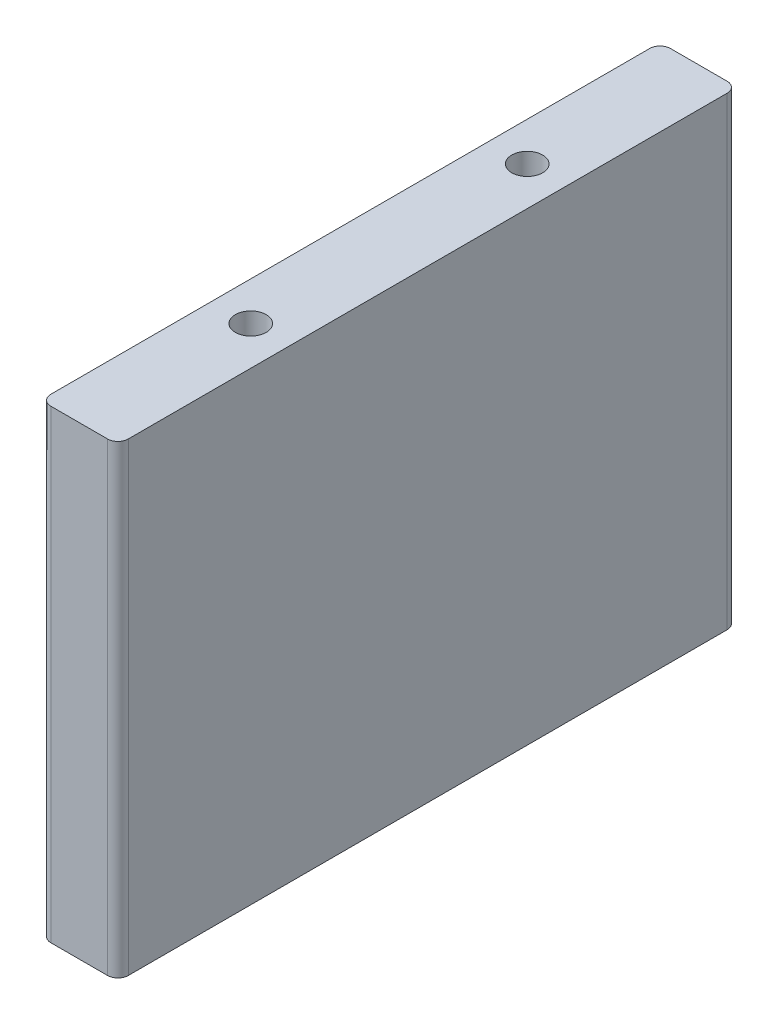
ISO-10303-21;
HEADER;
FILE_DESCRIPTION(('STEP AP214'),'2;1');
FILE_NAME('part.step','',(''),(''),'','','');
FILE_SCHEMA(('AUTOMOTIVE_DESIGN { 1 0 10303 214 1 1 1 1 }'));
ENDSEC;
DATA;
#1=APPLICATION_CONTEXT('core data for automotive mechanical design processes');
#2=APPLICATION_PROTOCOL_DEFINITION('international standard','automotive_design',2000,#1);
#3=PRODUCT_CONTEXT('',#1,'mechanical');
#4=PRODUCT('Part','Part','',(#3));
#5=PRODUCT_RELATED_PRODUCT_CATEGORY('part','',(#4));
#6=PRODUCT_DEFINITION_FORMATION('','',#4);
#7=PRODUCT_DEFINITION_CONTEXT('part definition',#1,'design');
#8=PRODUCT_DEFINITION('design','',#6,#7);
#9=PRODUCT_DEFINITION_SHAPE('','',#8);
#10=(LENGTH_UNIT() NAMED_UNIT(*) SI_UNIT(.MILLI.,.METRE.));
#11=(NAMED_UNIT(*) PLANE_ANGLE_UNIT() SI_UNIT($,.RADIAN.));
#12=(NAMED_UNIT(*) SI_UNIT($,.STERADIAN.) SOLID_ANGLE_UNIT());
#13=UNCERTAINTY_MEASURE_WITH_UNIT(LENGTH_MEASURE(1.E-05),#10,'distance_accuracy_value','');
#14=(GEOMETRIC_REPRESENTATION_CONTEXT(3) GLOBAL_UNCERTAINTY_ASSIGNED_CONTEXT((#13)) GLOBAL_UNIT_ASSIGNED_CONTEXT((#10,
#11,#12)) REPRESENTATION_CONTEXT('',''));
#15=CARTESIAN_POINT('',(0.,0.,0.));
#16=DIRECTION('',(0.,0.,1.));
#17=DIRECTION('',(1.,0.,0.));
#18=AXIS2_PLACEMENT_3D('',#15,#16,#17);
#19=CARTESIAN_POINT('',(-4.7625,28.575,-38.1));
#20=DIRECTION('',(1.,0.,0.));
#21=DIRECTION('',(0.,0.,-1.));
#22=AXIS2_PLACEMENT_3D('',#19,#20,#21);
#23=PLANE('',#22);
#24=DIRECTION('',(0.,0.,1.));
#25=VECTOR('',#24,1.);
#26=CARTESIAN_POINT('',(-4.7625,28.575,-38.1));
#27=LINE('',#26,#25);
#28=CARTESIAN_POINT('',(-4.7625,28.575,-36.83));
#29=VERTEX_POINT('',#28);
#30=CARTESIAN_POINT('',(-4.7625,28.575,36.83));
#31=VERTEX_POINT('',#30);
#32=EDGE_CURVE('E160',#29,#31,#27,.T.);
#33=ORIENTED_EDGE('',*,*,#32,.F.);
#34=DIRECTION('',(0.,-1.,0.));
#35=VECTOR('',#34,1.);
#36=CARTESIAN_POINT('',(-4.7625,28.575,-36.83));
#37=LINE('',#36,#35);
#38=CARTESIAN_POINT('',(-4.7625,-28.575,-36.83));
#39=VERTEX_POINT('',#38);
#40=EDGE_CURVE('E207',#29,#39,#37,.T.);
#41=ORIENTED_EDGE('',*,*,#40,.T.);
#42=DIRECTION('',(0.,0.,1.));
#43=VECTOR('',#42,1.);
#44=CARTESIAN_POINT('',(-4.7625,-28.575,-38.1));
#45=LINE('',#44,#43);
#46=CARTESIAN_POINT('',(-4.7625,-28.575,36.83));
#47=VERTEX_POINT('',#46);
#48=EDGE_CURVE('E159',#39,#47,#45,.T.);
#49=ORIENTED_EDGE('',*,*,#48,.T.);
#50=DIRECTION('',(0.,-1.,0.));
#51=VECTOR('',#50,1.);
#52=CARTESIAN_POINT('',(-4.7625,28.575,36.83));
#53=LINE('',#52,#51);
#54=EDGE_CURVE('E205',#47,#31,#53,.F.);
#55=ORIENTED_EDGE('',*,*,#54,.T.);
#56=EDGE_LOOP('',(#33,#41,#49,#55));
#57=FACE_BOUND('',#56,.T.);
#58=ADVANCED_FACE('F51',(#57),#23,.F.);
#59=CARTESIAN_POINT('',(-4.7625,28.575,38.1));
#60=DIRECTION('',(0.,0.,-1.));
#61=DIRECTION('',(-1.,0.,0.));
#62=AXIS2_PLACEMENT_3D('',#59,#60,#61);
#63=PLANE('',#62);
#64=DIRECTION('',(1.,0.,0.));
#65=VECTOR('',#64,1.);
#66=CARTESIAN_POINT('',(-4.7625,-28.575,38.1));
#67=LINE('',#66,#65);
#68=CARTESIAN_POINT('',(-3.4925,-28.575,38.1));
#69=VERTEX_POINT('',#68);
#70=CARTESIAN_POINT('',(3.4925,-28.575,38.1));
#71=VERTEX_POINT('',#70);
#72=EDGE_CURVE('E174',#69,#71,#67,.T.);
#73=ORIENTED_EDGE('',*,*,#72,.T.);
#74=DIRECTION('',(0.,-1.,0.));
#75=VECTOR('',#74,1.);
#76=CARTESIAN_POINT('',(3.4925,28.575,38.1));
#77=LINE('',#76,#75);
#78=CARTESIAN_POINT('',(3.4925,28.575,38.1));
#79=VERTEX_POINT('',#78);
#80=EDGE_CURVE('E11',#71,#79,#77,.F.);
#81=ORIENTED_EDGE('',*,*,#80,.T.);
#82=DIRECTION('',(1.,0.,0.));
#83=VECTOR('',#82,1.);
#84=CARTESIAN_POINT('',(-4.7625,28.575,38.1));
#85=LINE('',#84,#83);
#86=CARTESIAN_POINT('',(-3.4925,28.575,38.1));
#87=VERTEX_POINT('',#86);
#88=EDGE_CURVE('E162',#87,#79,#85,.T.);
#89=ORIENTED_EDGE('',*,*,#88,.F.);
#90=DIRECTION('',(0.,-1.,0.));
#91=VECTOR('',#90,1.);
#92=CARTESIAN_POINT('',(-3.4925,28.575,38.1));
#93=LINE('',#92,#91);
#94=EDGE_CURVE('E59',#87,#69,#93,.T.);
#95=ORIENTED_EDGE('',*,*,#94,.T.);
#96=EDGE_LOOP('',(#73,#81,#89,#95));
#97=FACE_BOUND('',#96,.T.);
#98=ADVANCED_FACE('F212',(#97),#63,.F.);
#99=CARTESIAN_POINT('',(4.7625,28.575,-38.1));
#100=DIRECTION('',(-1.,0.,0.));
#101=DIRECTION('',(0.,0.,1.));
#102=AXIS2_PLACEMENT_3D('',#99,#100,#101);
#103=PLANE('',#102);
#104=DIRECTION('',(0.,0.,-1.));
#105=VECTOR('',#104,1.);
#106=CARTESIAN_POINT('',(4.7625,-28.575,-38.1));
#107=LINE('',#106,#105);
#108=CARTESIAN_POINT('',(4.7625,-28.575,36.83));
#109=VERTEX_POINT('',#108);
#110=CARTESIAN_POINT('',(4.7625,-28.575,-36.83));
#111=VERTEX_POINT('',#110);
#112=EDGE_CURVE('E176',#109,#111,#107,.T.);
#113=ORIENTED_EDGE('',*,*,#112,.T.);
#114=DIRECTION('',(0.,-1.,0.));
#115=VECTOR('',#114,1.);
#116=CARTESIAN_POINT('',(4.7625,28.575,-36.83));
#117=LINE('',#116,#115);
#118=CARTESIAN_POINT('',(4.7625,28.575,-36.83));
#119=VERTEX_POINT('',#118);
#120=EDGE_CURVE('E196',#111,#119,#117,.F.);
#121=ORIENTED_EDGE('',*,*,#120,.T.);
#122=DIRECTION('',(0.,0.,-1.));
#123=VECTOR('',#122,1.);
#124=CARTESIAN_POINT('',(4.7625,28.575,-38.1));
#125=LINE('',#124,#123);
#126=CARTESIAN_POINT('',(4.7625,28.575,36.83));
#127=VERTEX_POINT('',#126);
#128=EDGE_CURVE('E165',#127,#119,#125,.T.);
#129=ORIENTED_EDGE('',*,*,#128,.F.);
#130=DIRECTION('',(0.,-1.,0.));
#131=VECTOR('',#130,1.);
#132=CARTESIAN_POINT('',(4.7625,28.575,36.83));
#133=LINE('',#132,#131);
#134=EDGE_CURVE('E193',#127,#109,#133,.T.);
#135=ORIENTED_EDGE('',*,*,#134,.T.);
#136=EDGE_LOOP('',(#113,#121,#129,#135));
#137=FACE_BOUND('',#136,.T.);
#138=ADVANCED_FACE('F225',(#137),#103,.F.);
#139=CARTESIAN_POINT('',(-4.7625,28.575,-38.1));
#140=DIRECTION('',(0.,0.,1.));
#141=DIRECTION('',(1.,0.,0.));
#142=AXIS2_PLACEMENT_3D('',#139,#140,#141);
#143=PLANE('',#142);
#144=DIRECTION('',(-1.,0.,0.));
#145=VECTOR('',#144,1.);
#146=CARTESIAN_POINT('',(-4.7625,28.575,-38.1));
#147=LINE('',#146,#145);
#148=CARTESIAN_POINT('',(3.49249999999999,28.575,-38.1));
#149=VERTEX_POINT('',#148);
#150=CARTESIAN_POINT('',(-3.4925,28.575,-38.1));
#151=VERTEX_POINT('',#150);
#152=EDGE_CURVE('E168',#149,#151,#147,.T.);
#153=ORIENTED_EDGE('',*,*,#152,.F.);
#154=DIRECTION('',(0.,-1.,0.));
#155=VECTOR('',#154,1.);
#156=CARTESIAN_POINT('',(3.4925,28.575,-38.1));
#157=LINE('',#156,#155);
#158=CARTESIAN_POINT('',(3.49249999999999,-28.575,-38.1));
#159=VERTEX_POINT('',#158);
#160=EDGE_CURVE('E182',#149,#159,#157,.T.);
#161=ORIENTED_EDGE('',*,*,#160,.T.);
#162=DIRECTION('',(-1.,0.,0.));
#163=VECTOR('',#162,1.);
#164=CARTESIAN_POINT('',(-4.7625,-28.575,-38.1));
#165=LINE('',#164,#163);
#166=CARTESIAN_POINT('',(-3.4925,-28.575,-38.1));
#167=VERTEX_POINT('',#166);
#168=EDGE_CURVE('E163',#159,#167,#165,.T.);
#169=ORIENTED_EDGE('',*,*,#168,.T.);
#170=DIRECTION('',(0.,-1.,0.));
#171=VECTOR('',#170,1.);
#172=CARTESIAN_POINT('',(-3.4925,28.575,-38.1));
#173=LINE('',#172,#171);
#174=EDGE_CURVE('E171',#167,#151,#173,.F.);
#175=ORIENTED_EDGE('',*,*,#174,.T.);
#176=EDGE_LOOP('',(#153,#161,#169,#175));
#177=FACE_BOUND('',#176,.T.);
#178=ADVANCED_FACE('F234',(#177),#143,.F.);
#179=CARTESIAN_POINT('',(0.,28.575,0.));
#180=DIRECTION('',(0.,1.,0.));
#181=DIRECTION('',(0.,0.,1.));
#182=AXIS2_PLACEMENT_3D('',#179,#180,#181);
#183=PLANE('',#182);
#184=CARTESIAN_POINT('',(0.,28.575,-16.9999999999955));
#185=DIRECTION('',(0.,1.,0.));
#186=DIRECTION('',(0.,0.,1.));
#187=AXIS2_PLACEMENT_3D('',#184,#185,#186);
#188=CIRCLE('',#187,1.89864999999999);
#189=CARTESIAN_POINT('',(0.,28.575,-15.1013499999955));
#190=VERTEX_POINT('',#189);
#191=EDGE_CURVE('E147',#190,#190,#188,.T.);
#192=ORIENTED_EDGE('',*,*,#191,.F.);
#193=EDGE_LOOP('',(#192));
#194=FACE_BOUND('',#193,.T.);
#195=CARTESIAN_POINT('',(0.,28.575,17.0000000000045));
#196=DIRECTION('',(0.,1.,0.));
#197=DIRECTION('',(0.,0.,1.));
#198=AXIS2_PLACEMENT_3D('',#195,#196,#197);
#199=CIRCLE('',#198,1.89864999999999);
#200=CARTESIAN_POINT('',(0.,28.575,18.8986500000045));
#201=VERTEX_POINT('',#200);
#202=EDGE_CURVE('E153',#201,#201,#199,.T.);
#203=ORIENTED_EDGE('',*,*,#202,.F.);
#204=EDGE_LOOP('',(#203));
#205=FACE_BOUND('',#204,.T.);
#206=ORIENTED_EDGE('',*,*,#128,.T.);
#207=CARTESIAN_POINT('',(3.4925,28.575,-36.83));
#208=DIRECTION('',(0.,1.,0.));
#209=DIRECTION('',(0.,0.,1.));
#210=AXIS2_PLACEMENT_3D('',#207,#208,#209);
#211=CIRCLE('',#210,1.27);
#212=EDGE_CURVE('E203',#119,#149,#211,.T.);
#213=ORIENTED_EDGE('',*,*,#212,.T.);
#214=ORIENTED_EDGE('',*,*,#152,.T.);
#215=CARTESIAN_POINT('',(-3.4925,28.575,-36.83));
#216=DIRECTION('',(0.,1.,0.));
#217=DIRECTION('',(0.,0.,1.));
#218=AXIS2_PLACEMENT_3D('',#215,#216,#217);
#219=CIRCLE('',#218,1.27);
#220=EDGE_CURVE('E201',#151,#29,#219,.T.);
#221=ORIENTED_EDGE('',*,*,#220,.T.);
#222=ORIENTED_EDGE('',*,*,#32,.T.);
#223=CARTESIAN_POINT('',(-3.4925,28.575,36.83));
#224=DIRECTION('',(0.,1.,0.));
#225=DIRECTION('',(0.,0.,1.));
#226=AXIS2_PLACEMENT_3D('',#223,#224,#225);
#227=CIRCLE('',#226,1.27);
#228=EDGE_CURVE('E71',#31,#87,#227,.T.);
#229=ORIENTED_EDGE('',*,*,#228,.T.);
#230=ORIENTED_EDGE('',*,*,#88,.T.);
#231=CARTESIAN_POINT('',(3.4925,28.575,36.83));
#232=DIRECTION('',(0.,1.,0.));
#233=DIRECTION('',(0.,0.,1.));
#234=AXIS2_PLACEMENT_3D('',#231,#232,#233);
#235=CIRCLE('',#234,1.27);
#236=EDGE_CURVE('E199',#79,#127,#235,.T.);
#237=ORIENTED_EDGE('',*,*,#236,.T.);
#238=EDGE_LOOP('',(#206,#213,#214,#221,#222,#229,#230,#237));
#239=FACE_BOUND('',#238,.T.);
#240=ADVANCED_FACE('F228',(#194,#205,#239),#183,.T.);
#241=CARTESIAN_POINT('',(0.,-28.575,0.));
#242=DIRECTION('',(0.,1.,0.));
#243=DIRECTION('',(0.,0.,1.));
#244=AXIS2_PLACEMENT_3D('',#241,#242,#243);
#245=PLANE('',#244);
#246=CARTESIAN_POINT('',(0.,-28.575,-16.9999999999955));
#247=DIRECTION('',(0.,-1.,0.));
#248=DIRECTION('',(0.,0.,-1.));
#249=AXIS2_PLACEMENT_3D('',#246,#247,#248);
#250=CIRCLE('',#249,1.89864999999999);
#251=CARTESIAN_POINT('',(0.,-28.575,-18.8986499999955));
#252=VERTEX_POINT('',#251);
#253=EDGE_CURVE('E137',#252,#252,#250,.T.);
#254=ORIENTED_EDGE('',*,*,#253,.F.);
#255=EDGE_LOOP('',(#254));
#256=FACE_BOUND('',#255,.T.);
#257=CARTESIAN_POINT('',(0.,-28.575,17.0000000000045));
#258=DIRECTION('',(0.,-1.,0.));
#259=DIRECTION('',(0.,0.,-1.));
#260=AXIS2_PLACEMENT_3D('',#257,#258,#259);
#261=CIRCLE('',#260,1.89864999999999);
#262=CARTESIAN_POINT('',(0.,-28.575,15.1013500000045));
#263=VERTEX_POINT('',#262);
#264=EDGE_CURVE('E136',#263,#263,#261,.T.);
#265=ORIENTED_EDGE('',*,*,#264,.F.);
#266=EDGE_LOOP('',(#265));
#267=FACE_BOUND('',#266,.T.);
#268=ORIENTED_EDGE('',*,*,#168,.F.);
#269=CARTESIAN_POINT('',(3.4925,-28.575,-36.83));
#270=DIRECTION('',(0.,1.,0.));
#271=DIRECTION('',(0.,0.,1.));
#272=AXIS2_PLACEMENT_3D('',#269,#270,#271);
#273=CIRCLE('',#272,1.27);
#274=EDGE_CURVE('E191',#159,#111,#273,.F.);
#275=ORIENTED_EDGE('',*,*,#274,.T.);
#276=ORIENTED_EDGE('',*,*,#112,.F.);
#277=CARTESIAN_POINT('',(3.4925,-28.575,36.83));
#278=DIRECTION('',(0.,1.,0.));
#279=DIRECTION('',(0.,0.,1.));
#280=AXIS2_PLACEMENT_3D('',#277,#278,#279);
#281=CIRCLE('',#280,1.27);
#282=EDGE_CURVE('E187',#109,#71,#281,.F.);
#283=ORIENTED_EDGE('',*,*,#282,.T.);
#284=ORIENTED_EDGE('',*,*,#72,.F.);
#285=CARTESIAN_POINT('',(-3.4925,-28.575,36.83));
#286=DIRECTION('',(0.,1.,0.));
#287=DIRECTION('',(0.,0.,1.));
#288=AXIS2_PLACEMENT_3D('',#285,#286,#287);
#289=CIRCLE('',#288,1.27);
#290=EDGE_CURVE('E185',#69,#47,#289,.F.);
#291=ORIENTED_EDGE('',*,*,#290,.T.);
#292=ORIENTED_EDGE('',*,*,#48,.F.);
#293=CARTESIAN_POINT('',(-3.4925,-28.575,-36.83));
#294=DIRECTION('',(0.,1.,0.));
#295=DIRECTION('',(0.,0.,1.));
#296=AXIS2_PLACEMENT_3D('',#293,#294,#295);
#297=CIRCLE('',#296,1.27);
#298=EDGE_CURVE('E189',#39,#167,#297,.F.);
#299=ORIENTED_EDGE('',*,*,#298,.T.);
#300=EDGE_LOOP('',(#268,#275,#276,#283,#284,#291,#292,#299));
#301=FACE_BOUND('',#300,.T.);
#302=ADVANCED_FACE('F216',(#256,#267,#301),#245,.F.);
#303=CARTESIAN_POINT('',(0.,9.525,17.0000000000045));
#304=DIRECTION('',(0.,1.,0.));
#305=DIRECTION('',(0.,0.,1.));
#306=AXIS2_PLACEMENT_3D('',#303,#304,#305);
#307=CONICAL_SURFACE('',#306,1.89865,1.02974425867665);
#308=CARTESIAN_POINT('',(0.,8.38417598568333,17.0000000000045));
#309=VERTEX_POINT('',#308);
#310=VERTEX_LOOP('',#309);
#311=FACE_BOUND('',#310,.T.);
#312=CARTESIAN_POINT('',(0.,9.525,17.0000000000045));
#313=DIRECTION('',(0.,1.,0.));
#314=DIRECTION('',(0.,0.,1.));
#315=AXIS2_PLACEMENT_3D('',#312,#313,#314);
#316=CIRCLE('',#315,1.89865);
#317=CARTESIAN_POINT('',(0.,9.525,18.8986500000045));
#318=VERTEX_POINT('',#317);
#319=EDGE_CURVE('E156',#318,#318,#316,.T.);
#320=ORIENTED_EDGE('',*,*,#319,.T.);
#321=EDGE_LOOP('',(#320));
#322=FACE_BOUND('',#321,.T.);
#323=ADVANCED_FACE('F337',(#311,#322),#307,.F.);
#324=CARTESIAN_POINT('',(0.,28.575,17.0000000000045));
#325=DIRECTION('',(0.,1.,0.));
#326=DIRECTION('',(0.,0.,1.));
#327=AXIS2_PLACEMENT_3D('',#324,#325,#326);
#328=CYLINDRICAL_SURFACE('',#327,1.89864999999999);
#329=ORIENTED_EDGE('',*,*,#319,.F.);
#330=EDGE_LOOP('',(#329));
#331=FACE_BOUND('',#330,.T.);
#332=ORIENTED_EDGE('',*,*,#202,.T.);
#333=EDGE_LOOP('',(#332));
#334=FACE_BOUND('',#333,.T.);
#335=ADVANCED_FACE('F328',(#331,#334),#328,.F.);
#336=CARTESIAN_POINT('',(0.,9.525,-16.9999999999955));
#337=DIRECTION('',(0.,1.,0.));
#338=DIRECTION('',(0.,0.,1.));
#339=AXIS2_PLACEMENT_3D('',#336,#337,#338);
#340=CONICAL_SURFACE('',#339,1.89865,1.02974425867665);
#341=CARTESIAN_POINT('',(0.,8.38417598568333,-16.9999999999955));
#342=VERTEX_POINT('',#341);
#343=VERTEX_LOOP('',#342);
#344=FACE_BOUND('',#343,.T.);
#345=CARTESIAN_POINT('',(0.,9.525,-16.9999999999955));
#346=DIRECTION('',(0.,1.,0.));
#347=DIRECTION('',(0.,0.,1.));
#348=AXIS2_PLACEMENT_3D('',#345,#346,#347);
#349=CIRCLE('',#348,1.89865);
#350=CARTESIAN_POINT('',(0.,9.525,-15.1013499999955));
#351=VERTEX_POINT('',#350);
#352=EDGE_CURVE('E150',#351,#351,#349,.T.);
#353=ORIENTED_EDGE('',*,*,#352,.T.);
#354=EDGE_LOOP('',(#353));
#355=FACE_BOUND('',#354,.T.);
#356=ADVANCED_FACE('F318',(#344,#355),#340,.F.);
#357=CARTESIAN_POINT('',(0.,28.575,-16.9999999999955));
#358=DIRECTION('',(0.,1.,0.));
#359=DIRECTION('',(0.,0.,1.));
#360=AXIS2_PLACEMENT_3D('',#357,#358,#359);
#361=CYLINDRICAL_SURFACE('',#360,1.89864999999999);
#362=ORIENTED_EDGE('',*,*,#352,.F.);
#363=EDGE_LOOP('',(#362));
#364=FACE_BOUND('',#363,.T.);
#365=ORIENTED_EDGE('',*,*,#191,.T.);
#366=EDGE_LOOP('',(#365));
#367=FACE_BOUND('',#366,.T.);
#368=ADVANCED_FACE('F309',(#364,#367),#361,.F.);
#369=CARTESIAN_POINT('',(0.,-9.525,17.0000000000045));
#370=DIRECTION('',(0.,-1.,0.));
#371=DIRECTION('',(0.,0.,-1.));
#372=AXIS2_PLACEMENT_3D('',#369,#370,#371);
#373=CONICAL_SURFACE('',#372,1.89865,1.02974425867665);
#374=CARTESIAN_POINT('',(0.,-8.38417598568333,17.0000000000045));
#375=VERTEX_POINT('',#374);
#376=VERTEX_LOOP('',#375);
#377=FACE_BOUND('',#376,.T.);
#378=CARTESIAN_POINT('',(0.,-9.525,17.0000000000045));
#379=DIRECTION('',(0.,-1.,0.));
#380=DIRECTION('',(0.,0.,-1.));
#381=AXIS2_PLACEMENT_3D('',#378,#379,#380);
#382=CIRCLE('',#381,1.89865);
#383=CARTESIAN_POINT('',(0.,-9.525,15.1013500000045));
#384=VERTEX_POINT('',#383);
#385=EDGE_CURVE('E140',#384,#384,#382,.T.);
#386=ORIENTED_EDGE('',*,*,#385,.T.);
#387=EDGE_LOOP('',(#386));
#388=FACE_BOUND('',#387,.T.);
#389=ADVANCED_FACE('F299',(#377,#388),#373,.F.);
#390=CARTESIAN_POINT('',(0.,-28.575,17.0000000000045));
#391=DIRECTION('',(0.,-1.,0.));
#392=DIRECTION('',(0.,0.,-1.));
#393=AXIS2_PLACEMENT_3D('',#390,#391,#392);
#394=CYLINDRICAL_SURFACE('',#393,1.89864999999999);
#395=ORIENTED_EDGE('',*,*,#385,.F.);
#396=EDGE_LOOP('',(#395));
#397=FACE_BOUND('',#396,.T.);
#398=ORIENTED_EDGE('',*,*,#264,.T.);
#399=EDGE_LOOP('',(#398));
#400=FACE_BOUND('',#399,.T.);
#401=ADVANCED_FACE('F130',(#397,#400),#394,.F.);
#402=CARTESIAN_POINT('',(0.,-9.525,-16.9999999999955));
#403=DIRECTION('',(0.,-1.,0.));
#404=DIRECTION('',(0.,0.,-1.));
#405=AXIS2_PLACEMENT_3D('',#402,#403,#404);
#406=CONICAL_SURFACE('',#405,1.89865,1.02974425867665);
#407=CARTESIAN_POINT('',(0.,-8.38417598568333,-16.9999999999955));
#408=VERTEX_POINT('',#407);
#409=VERTEX_LOOP('',#408);
#410=FACE_BOUND('',#409,.T.);
#411=CARTESIAN_POINT('',(0.,-9.525,-16.9999999999955));
#412=DIRECTION('',(0.,-1.,0.));
#413=DIRECTION('',(0.,0.,-1.));
#414=AXIS2_PLACEMENT_3D('',#411,#412,#413);
#415=CIRCLE('',#414,1.89865);
#416=CARTESIAN_POINT('',(0.,-9.525,-18.8986499999955));
#417=VERTEX_POINT('',#416);
#418=EDGE_CURVE('E134',#417,#417,#415,.T.);
#419=ORIENTED_EDGE('',*,*,#418,.T.);
#420=EDGE_LOOP('',(#419));
#421=FACE_BOUND('',#420,.T.);
#422=ADVANCED_FACE('F126',(#410,#421),#406,.F.);
#423=CARTESIAN_POINT('',(0.,-28.575,-16.9999999999955));
#424=DIRECTION('',(0.,-1.,0.));
#425=DIRECTION('',(0.,0.,-1.));
#426=AXIS2_PLACEMENT_3D('',#423,#424,#425);
#427=CYLINDRICAL_SURFACE('',#426,1.89864999999999);
#428=ORIENTED_EDGE('',*,*,#418,.F.);
#429=EDGE_LOOP('',(#428));
#430=FACE_BOUND('',#429,.T.);
#431=ORIENTED_EDGE('',*,*,#253,.T.);
#432=EDGE_LOOP('',(#431));
#433=FACE_BOUND('',#432,.T.);
#434=ADVANCED_FACE('F129',(#430,#433),#427,.F.);
#435=CARTESIAN_POINT('',(3.4925,28.575,-36.83));
#436=DIRECTION('',(0.,-1.,0.));
#437=DIRECTION('',(0.,0.,-1.));
#438=AXIS2_PLACEMENT_3D('',#435,#436,#437);
#439=CYLINDRICAL_SURFACE('',#438,1.27);
#440=ORIENTED_EDGE('',*,*,#212,.F.);
#441=ORIENTED_EDGE('',*,*,#120,.F.);
#442=ORIENTED_EDGE('',*,*,#274,.F.);
#443=ORIENTED_EDGE('',*,*,#160,.F.);
#444=EDGE_LOOP('',(#440,#441,#442,#443));
#445=FACE_BOUND('',#444,.T.);
#446=ADVANCED_FACE('F232',(#445),#439,.T.);
#447=CARTESIAN_POINT('',(-3.4925,28.575,-36.83));
#448=DIRECTION('',(0.,-1.,0.));
#449=DIRECTION('',(0.,0.,-1.));
#450=AXIS2_PLACEMENT_3D('',#447,#448,#449);
#451=CYLINDRICAL_SURFACE('',#450,1.27);
#452=ORIENTED_EDGE('',*,*,#220,.F.);
#453=ORIENTED_EDGE('',*,*,#174,.F.);
#454=ORIENTED_EDGE('',*,*,#298,.F.);
#455=ORIENTED_EDGE('',*,*,#40,.F.);
#456=EDGE_LOOP('',(#452,#453,#454,#455));
#457=FACE_BOUND('',#456,.T.);
#458=ADVANCED_FACE('F239',(#457),#451,.T.);
#459=CARTESIAN_POINT('',(3.4925,28.575,36.83));
#460=DIRECTION('',(0.,-1.,0.));
#461=DIRECTION('',(0.,0.,-1.));
#462=AXIS2_PLACEMENT_3D('',#459,#460,#461);
#463=CYLINDRICAL_SURFACE('',#462,1.27);
#464=ORIENTED_EDGE('',*,*,#236,.F.);
#465=ORIENTED_EDGE('',*,*,#80,.F.);
#466=ORIENTED_EDGE('',*,*,#282,.F.);
#467=ORIENTED_EDGE('',*,*,#134,.F.);
#468=EDGE_LOOP('',(#464,#465,#466,#467));
#469=FACE_BOUND('',#468,.T.);
#470=ADVANCED_FACE('F222',(#469),#463,.T.);
#471=CARTESIAN_POINT('',(-3.4925,28.575,36.83));
#472=DIRECTION('',(0.,-1.,0.));
#473=DIRECTION('',(0.,0.,-1.));
#474=AXIS2_PLACEMENT_3D('',#471,#472,#473);
#475=CYLINDRICAL_SURFACE('',#474,1.27);
#476=ORIENTED_EDGE('',*,*,#228,.F.);
#477=ORIENTED_EDGE('',*,*,#54,.F.);
#478=ORIENTED_EDGE('',*,*,#290,.F.);
#479=ORIENTED_EDGE('',*,*,#94,.F.);
#480=EDGE_LOOP('',(#476,#477,#478,#479));
#481=FACE_BOUND('',#480,.T.);
#482=ADVANCED_FACE('F53',(#481),#475,.T.);
#483=CLOSED_SHELL('',(#58,#98,#138,#178,#240,#302,#323,#335,#356,#368,#389,#401,#422,#434,#446,
#458,#470,#482));
#484=MANIFOLD_SOLID_BREP('B2',#483);
#485=ADVANCED_BREP_SHAPE_REPRESENTATION('',(#18,#484),#14);
#486=SHAPE_DEFINITION_REPRESENTATION(#9,#485);
ENDSEC;
END-ISO-10303-21;
